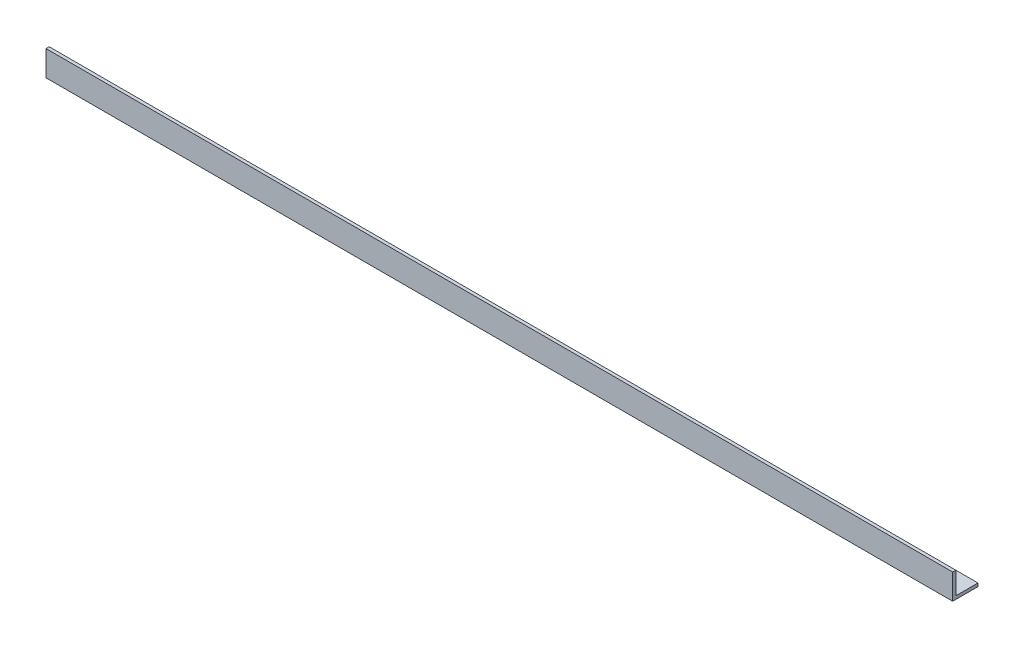
ISO-10303-21;
HEADER;
FILE_DESCRIPTION(('STEP AP214'),'2;1');
FILE_NAME('part.step','',(''),(''),'','','');
FILE_SCHEMA(('AUTOMOTIVE_DESIGN { 1 0 10303 214 1 1 1 1 }'));
ENDSEC;
DATA;
#1=APPLICATION_CONTEXT('core data for automotive mechanical design processes');
#2=APPLICATION_PROTOCOL_DEFINITION('international standard','automotive_design',2000,#1);
#3=PRODUCT_CONTEXT('',#1,'mechanical');
#4=PRODUCT('Part','Part','',(#3));
#5=PRODUCT_RELATED_PRODUCT_CATEGORY('part','',(#4));
#6=PRODUCT_DEFINITION_FORMATION('','',#4);
#7=PRODUCT_DEFINITION_CONTEXT('part definition',#1,'design');
#8=PRODUCT_DEFINITION('design','',#6,#7);
#9=PRODUCT_DEFINITION_SHAPE('','',#8);
#10=(LENGTH_UNIT() NAMED_UNIT(*) SI_UNIT(.MILLI.,.METRE.));
#11=(NAMED_UNIT(*) PLANE_ANGLE_UNIT() SI_UNIT($,.RADIAN.));
#12=(NAMED_UNIT(*) SI_UNIT($,.STERADIAN.) SOLID_ANGLE_UNIT());
#13=UNCERTAINTY_MEASURE_WITH_UNIT(LENGTH_MEASURE(1.E-05),#10,'distance_accuracy_value','');
#14=(GEOMETRIC_REPRESENTATION_CONTEXT(3) GLOBAL_UNCERTAINTY_ASSIGNED_CONTEXT((#13)) GLOBAL_UNIT_ASSIGNED_CONTEXT((#10,
#11,#12)) REPRESENTATION_CONTEXT('',''));
#15=CARTESIAN_POINT('',(0.,0.,0.));
#16=DIRECTION('',(0.,0.,1.));
#17=DIRECTION('',(1.,0.,0.));
#18=AXIS2_PLACEMENT_3D('',#15,#16,#17);
#19=CARTESIAN_POINT('',(454.025,0.,-25.4000000000005));
#20=DIRECTION('',(0.,1.,0.));
#21=DIRECTION('',(0.,0.,1.00000000000002));
#22=AXIS2_PLACEMENT_3D('',#19,#20,#21);
#23=PLANE('',#22);
#24=DIRECTION('',(0.,0.,-1.00000000000002));
#25=VECTOR('',#24,1.);
#26=CARTESIAN_POINT('',(-454.025,0.,-25.4000000000005));
#27=LINE('',#26,#25);
#28=CARTESIAN_POINT('',(-454.025,0.,0.));
#29=VERTEX_POINT('',#28);
#30=CARTESIAN_POINT('',(-454.025,0.,-25.4000000000005));
#31=VERTEX_POINT('',#30);
#32=EDGE_CURVE('E146',#29,#31,#27,.T.);
#33=ORIENTED_EDGE('',*,*,#32,.T.);
#34=DIRECTION('',(-1.,0.,0.));
#35=VECTOR('',#34,1.);
#36=CARTESIAN_POINT('',(454.025,0.,-25.4000000000005));
#37=LINE('',#36,#35);
#38=CARTESIAN_POINT('',(454.025,0.,-25.4000000000005));
#39=VERTEX_POINT('',#38);
#40=EDGE_CURVE('E11',#39,#31,#37,.T.);
#41=ORIENTED_EDGE('',*,*,#40,.F.);
#42=DIRECTION('',(0.,0.,-1.00000000000002));
#43=VECTOR('',#42,1.);
#44=CARTESIAN_POINT('',(454.025,0.,-25.4000000000005));
#45=LINE('',#44,#43);
#46=CARTESIAN_POINT('',(454.025,0.,0.));
#47=VERTEX_POINT('',#46);
#48=EDGE_CURVE('E161',#47,#39,#45,.T.);
#49=ORIENTED_EDGE('',*,*,#48,.F.);
#50=DIRECTION('',(-1.,0.,0.));
#51=VECTOR('',#50,1.);
#52=CARTESIAN_POINT('',(454.025,0.,0.));
#53=LINE('',#52,#51);
#54=EDGE_CURVE('E142',#47,#29,#53,.T.);
#55=ORIENTED_EDGE('',*,*,#54,.T.);
#56=EDGE_LOOP('',(#33,#41,#49,#55));
#57=FACE_BOUND('',#56,.T.);
#58=ADVANCED_FACE('F42',(#57),#23,.F.);
#59=CARTESIAN_POINT('',(454.025,3.17500000000004,-25.4000000000005));
#60=DIRECTION('',(0.,0.,1.00000000000002));
#61=DIRECTION('',(1.,0.,0.));
#62=AXIS2_PLACEMENT_3D('',#59,#60,#61);
#63=PLANE('',#62);
#64=DIRECTION('',(0.,1.,0.));
#65=VECTOR('',#64,1.);
#66=CARTESIAN_POINT('',(-454.025,3.17500000000004,-25.4000000000005));
#67=LINE('',#66,#65);
#68=CARTESIAN_POINT('',(-454.025,3.17500000000004,-25.4000000000005));
#69=VERTEX_POINT('',#68);
#70=EDGE_CURVE('E149',#31,#69,#67,.T.);
#71=ORIENTED_EDGE('',*,*,#70,.T.);
#72=DIRECTION('',(-1.,0.,0.));
#73=VECTOR('',#72,1.);
#74=CARTESIAN_POINT('',(454.025,3.17500000000004,-25.4000000000005));
#75=LINE('',#74,#73);
#76=CARTESIAN_POINT('',(454.025,3.17500000000004,-25.4000000000005));
#77=VERTEX_POINT('',#76);
#78=EDGE_CURVE('E51',#77,#69,#75,.T.);
#79=ORIENTED_EDGE('',*,*,#78,.F.);
#80=DIRECTION('',(0.,1.,0.));
#81=VECTOR('',#80,1.);
#82=CARTESIAN_POINT('',(454.025,3.17500000000004,-25.4000000000005));
#83=LINE('',#82,#81);
#84=EDGE_CURVE('E107',#39,#77,#83,.T.);
#85=ORIENTED_EDGE('',*,*,#84,.F.);
#86=ORIENTED_EDGE('',*,*,#40,.T.);
#87=EDGE_LOOP('',(#71,#79,#85,#86));
#88=FACE_BOUND('',#87,.T.);
#89=ADVANCED_FACE('F190',(#88),#63,.F.);
#90=CARTESIAN_POINT('',(454.025,3.17499999999993,-3.17500000000017));
#91=DIRECTION('',(0.,-1.,0.));
#92=DIRECTION('',(0.,0.,-1.00000000000002));
#93=AXIS2_PLACEMENT_3D('',#90,#91,#92);
#94=PLANE('',#93);
#95=DIRECTION('',(0.,0.,1.00000000000002));
#96=VECTOR('',#95,1.);
#97=CARTESIAN_POINT('',(-454.025,3.17499999999993,-3.17500000000017));
#98=LINE('',#97,#96);
#99=CARTESIAN_POINT('',(-454.025,3.17499999999993,-3.17500000000017));
#100=VERTEX_POINT('',#99);
#101=EDGE_CURVE('E152',#69,#100,#98,.T.);
#102=ORIENTED_EDGE('',*,*,#101,.T.);
#103=DIRECTION('',(-1.,0.,0.));
#104=VECTOR('',#103,1.);
#105=CARTESIAN_POINT('',(454.025,3.17499999999993,-3.17500000000017));
#106=LINE('',#105,#104);
#107=CARTESIAN_POINT('',(454.025,3.17499999999993,-3.17500000000017));
#108=VERTEX_POINT('',#107);
#109=EDGE_CURVE('E132',#108,#100,#106,.T.);
#110=ORIENTED_EDGE('',*,*,#109,.F.);
#111=DIRECTION('',(0.,0.,1.00000000000002));
#112=VECTOR('',#111,1.);
#113=CARTESIAN_POINT('',(454.025,3.17499999999993,-3.17500000000017));
#114=LINE('',#113,#112);
#115=EDGE_CURVE('E121',#77,#108,#114,.T.);
#116=ORIENTED_EDGE('',*,*,#115,.F.);
#117=ORIENTED_EDGE('',*,*,#78,.T.);
#118=EDGE_LOOP('',(#102,#110,#116,#117));
#119=FACE_BOUND('',#118,.T.);
#120=ADVANCED_FACE('F172',(#119),#94,.F.);
#121=CARTESIAN_POINT('',(454.025,25.4,-3.17499999999922));
#122=DIRECTION('',(0.,0.,1.00000000000002));
#123=DIRECTION('',(0.,-1.,0.));
#124=AXIS2_PLACEMENT_3D('',#121,#122,#123);
#125=PLANE('',#124);
#126=DIRECTION('',(0.,1.,0.));
#127=VECTOR('',#126,1.);
#128=CARTESIAN_POINT('',(-454.025,25.4,-3.17499999999922));
#129=LINE('',#128,#127);
#130=CARTESIAN_POINT('',(-454.025,25.4,-3.17499999999922));
#131=VERTEX_POINT('',#130);
#132=EDGE_CURVE('E130',#100,#131,#129,.T.);
#133=ORIENTED_EDGE('',*,*,#132,.T.);
#134=DIRECTION('',(-1.,0.,0.));
#135=VECTOR('',#134,1.);
#136=CARTESIAN_POINT('',(454.025,25.4,-3.17499999999922));
#137=LINE('',#136,#135);
#138=CARTESIAN_POINT('',(454.025,25.4,-3.17499999999922));
#139=VERTEX_POINT('',#138);
#140=EDGE_CURVE('E127',#139,#131,#137,.T.);
#141=ORIENTED_EDGE('',*,*,#140,.F.);
#142=DIRECTION('',(0.,1.,0.));
#143=VECTOR('',#142,1.);
#144=CARTESIAN_POINT('',(454.025,25.4,-3.17499999999922));
#145=LINE('',#144,#143);
#146=EDGE_CURVE('E115',#108,#139,#145,.T.);
#147=ORIENTED_EDGE('',*,*,#146,.F.);
#148=ORIENTED_EDGE('',*,*,#109,.T.);
#149=EDGE_LOOP('',(#133,#141,#147,#148));
#150=FACE_BOUND('',#149,.T.);
#151=ADVANCED_FACE('F128',(#150),#125,.F.);
#152=CARTESIAN_POINT('',(454.025,25.4,9.55398954394227E-13));
#153=DIRECTION('',(0.,-1.,0.));
#154=DIRECTION('',(0.,0.,-1.00000000000002));
#155=AXIS2_PLACEMENT_3D('',#152,#153,#154);
#156=PLANE('',#155);
#157=DIRECTION('',(0.,0.,1.00000000000002));
#158=VECTOR('',#157,1.);
#159=CARTESIAN_POINT('',(-454.025,25.4,9.55398954394227E-13));
#160=LINE('',#159,#158);
#161=CARTESIAN_POINT('',(-454.025,25.4,9.55398954394227E-13));
#162=VERTEX_POINT('',#161);
#163=EDGE_CURVE('E91',#131,#162,#160,.T.);
#164=ORIENTED_EDGE('',*,*,#163,.T.);
#165=DIRECTION('',(-1.,0.,0.));
#166=VECTOR('',#165,1.);
#167=CARTESIAN_POINT('',(454.025,25.4,9.55398954394227E-13));
#168=LINE('',#167,#166);
#169=CARTESIAN_POINT('',(454.025,25.4,9.55398954394227E-13));
#170=VERTEX_POINT('',#169);
#171=EDGE_CURVE('E133',#170,#162,#168,.T.);
#172=ORIENTED_EDGE('',*,*,#171,.F.);
#173=DIRECTION('',(0.,0.,1.00000000000002));
#174=VECTOR('',#173,1.);
#175=CARTESIAN_POINT('',(454.025,25.4,9.55398954394227E-13));
#176=LINE('',#175,#174);
#177=EDGE_CURVE('E119',#139,#170,#176,.T.);
#178=ORIENTED_EDGE('',*,*,#177,.F.);
#179=ORIENTED_EDGE('',*,*,#140,.T.);
#180=EDGE_LOOP('',(#164,#172,#178,#179));
#181=FACE_BOUND('',#180,.T.);
#182=ADVANCED_FACE('F135',(#181),#156,.F.);
#183=CARTESIAN_POINT('',(454.025,0.,0.));
#184=DIRECTION('',(0.,0.,-1.00000000000002));
#185=DIRECTION('',(0.,1.,0.));
#186=AXIS2_PLACEMENT_3D('',#183,#184,#185);
#187=PLANE('',#186);
#188=DIRECTION('',(0.,-1.,0.));
#189=VECTOR('',#188,1.);
#190=CARTESIAN_POINT('',(-454.025,0.,0.));
#191=LINE('',#190,#189);
#192=EDGE_CURVE('E98',#162,#29,#191,.T.);
#193=ORIENTED_EDGE('',*,*,#192,.T.);
#194=ORIENTED_EDGE('',*,*,#54,.F.);
#195=DIRECTION('',(0.,-1.,0.));
#196=VECTOR('',#195,1.);
#197=CARTESIAN_POINT('',(454.025,0.,0.));
#198=LINE('',#197,#196);
#199=EDGE_CURVE('E62',#170,#47,#198,.T.);
#200=ORIENTED_EDGE('',*,*,#199,.F.);
#201=ORIENTED_EDGE('',*,*,#171,.T.);
#202=EDGE_LOOP('',(#193,#194,#200,#201));
#203=FACE_BOUND('',#202,.T.);
#204=ADVANCED_FACE('F179',(#203),#187,.F.);
#205=CARTESIAN_POINT('',(454.025,0.,0.));
#206=DIRECTION('',(-1.,0.,0.));
#207=DIRECTION('',(0.,0.,1.00000000000002));
#208=AXIS2_PLACEMENT_3D('',#205,#206,#207);
#209=PLANE('',#208);
#210=ORIENTED_EDGE('',*,*,#48,.T.);
#211=ORIENTED_EDGE('',*,*,#84,.T.);
#212=ORIENTED_EDGE('',*,*,#115,.T.);
#213=ORIENTED_EDGE('',*,*,#146,.T.);
#214=ORIENTED_EDGE('',*,*,#177,.T.);
#215=ORIENTED_EDGE('',*,*,#199,.T.);
#216=EDGE_LOOP('',(#210,#211,#212,#213,#214,#215));
#217=FACE_BOUND('',#216,.T.);
#218=ADVANCED_FACE('F117',(#217),#209,.F.);
#219=CARTESIAN_POINT('',(-454.025,0.,0.));
#220=DIRECTION('',(-1.,0.,0.));
#221=DIRECTION('',(0.,0.,1.00000000000002));
#222=AXIS2_PLACEMENT_3D('',#219,#220,#221);
#223=PLANE('',#222);
#224=ORIENTED_EDGE('',*,*,#32,.F.);
#225=ORIENTED_EDGE('',*,*,#192,.F.);
#226=ORIENTED_EDGE('',*,*,#163,.F.);
#227=ORIENTED_EDGE('',*,*,#132,.F.);
#228=ORIENTED_EDGE('',*,*,#101,.F.);
#229=ORIENTED_EDGE('',*,*,#70,.F.);
#230=EDGE_LOOP('',(#224,#225,#226,#227,#228,#229));
#231=FACE_BOUND('',#230,.T.);
#232=ADVANCED_FACE('F175',(#231),#223,.T.);
#233=CLOSED_SHELL('',(#58,#89,#120,#151,#182,#204,#218,#232));
#234=MANIFOLD_SOLID_BREP('B2',#233);
#235=ADVANCED_BREP_SHAPE_REPRESENTATION('',(#18,#234),#14);
#236=SHAPE_DEFINITION_REPRESENTATION(#9,#235);
ENDSEC;
END-ISO-10303-21;
